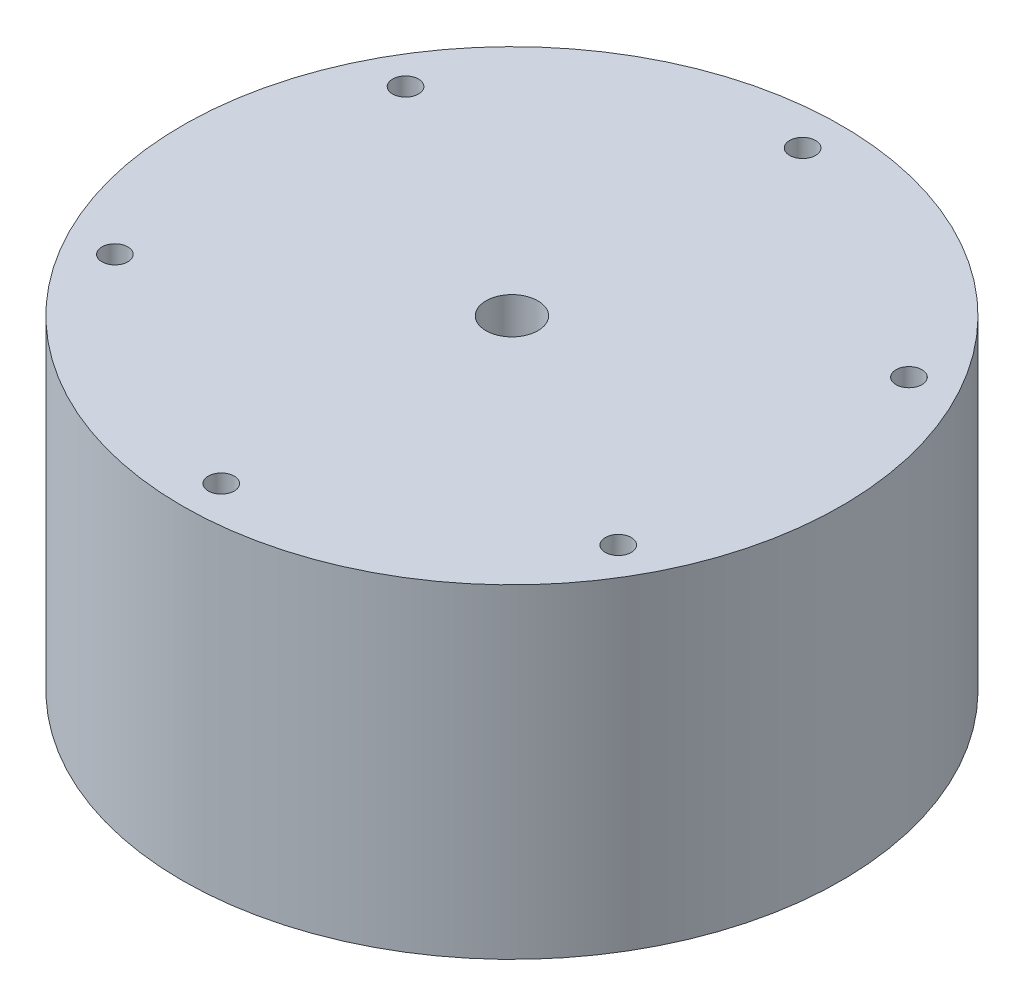
ISO-10303-21;
HEADER;
FILE_DESCRIPTION(('STEP AP214'),'2;1');
FILE_NAME('part.step','',(''),(''),'','','');
FILE_SCHEMA(('AUTOMOTIVE_DESIGN { 1 0 10303 214 1 1 1 1 }'));
ENDSEC;
DATA;
#1=APPLICATION_CONTEXT('core data for automotive mechanical design processes');
#2=APPLICATION_PROTOCOL_DEFINITION('international standard','automotive_design',2000,#1);
#3=PRODUCT_CONTEXT('',#1,'mechanical');
#4=PRODUCT('Part','Part','',(#3));
#5=PRODUCT_RELATED_PRODUCT_CATEGORY('part','',(#4));
#6=PRODUCT_DEFINITION_FORMATION('','',#4);
#7=PRODUCT_DEFINITION_CONTEXT('part definition',#1,'design');
#8=PRODUCT_DEFINITION('design','',#6,#7);
#9=PRODUCT_DEFINITION_SHAPE('','',#8);
#10=(LENGTH_UNIT() NAMED_UNIT(*) SI_UNIT(.MILLI.,.METRE.));
#11=(NAMED_UNIT(*) PLANE_ANGLE_UNIT() SI_UNIT($,.RADIAN.));
#12=(NAMED_UNIT(*) SI_UNIT($,.STERADIAN.) SOLID_ANGLE_UNIT());
#13=UNCERTAINTY_MEASURE_WITH_UNIT(LENGTH_MEASURE(1.E-05),#10,'distance_accuracy_value','');
#14=(GEOMETRIC_REPRESENTATION_CONTEXT(3) GLOBAL_UNCERTAINTY_ASSIGNED_CONTEXT((#13)) GLOBAL_UNIT_ASSIGNED_CONTEXT((#10,
#11,#12)) REPRESENTATION_CONTEXT('',''));
#15=CARTESIAN_POINT('',(0.,0.,0.));
#16=DIRECTION('',(0.,0.,1.));
#17=DIRECTION('',(1.,0.,0.));
#18=AXIS2_PLACEMENT_3D('',#15,#16,#17);
#19=CARTESIAN_POINT('',(0.,50.,0.));
#20=DIRECTION('',(0.,-1.,0.));
#21=DIRECTION('',(0.,0.,-1.));
#22=AXIS2_PLACEMENT_3D('',#19,#20,#21);
#23=CYLINDRICAL_SURFACE('',#22,50.8);
#24=CARTESIAN_POINT('',(0.,50.,0.));
#25=DIRECTION('',(0.,1.,0.));
#26=DIRECTION('',(0.,0.,1.));
#27=AXIS2_PLACEMENT_3D('',#24,#25,#26);
#28=CIRCLE('',#27,50.8);
#29=CARTESIAN_POINT('',(0.,50.,50.8));
#30=VERTEX_POINT('',#29);
#31=EDGE_CURVE('E10',#30,#30,#28,.T.);
#32=ORIENTED_EDGE('',*,*,#31,.F.);
#33=EDGE_LOOP('',(#32));
#34=FACE_BOUND('',#33,.T.);
#35=CARTESIAN_POINT('',(0.,0.,0.));
#36=DIRECTION('',(0.,1.,0.));
#37=DIRECTION('',(0.,0.,1.));
#38=AXIS2_PLACEMENT_3D('',#35,#36,#37);
#39=CIRCLE('',#38,50.8);
#40=CARTESIAN_POINT('',(0.,0.,50.8));
#41=VERTEX_POINT('',#40);
#42=EDGE_CURVE('E48',#41,#41,#39,.T.);
#43=ORIENTED_EDGE('',*,*,#42,.T.);
#44=EDGE_LOOP('',(#43));
#45=FACE_BOUND('',#44,.T.);
#46=ADVANCED_FACE('F41',(#34,#45),#23,.T.);
#47=CARTESIAN_POINT('',(0.,50.,0.));
#48=DIRECTION('',(0.,1.,0.));
#49=DIRECTION('',(0.,0.,1.));
#50=AXIS2_PLACEMENT_3D('',#47,#48,#49);
#51=PLANE('',#50);
#52=CARTESIAN_POINT('',(-38.7979380895426,50.,-22.4000000000004));
#53=DIRECTION('',(0.,1.,0.));
#54=DIRECTION('',(0.,0.,1.));
#55=AXIS2_PLACEMENT_3D('',#52,#53,#54);
#56=CIRCLE('',#55,2.);
#57=CARTESIAN_POINT('',(-38.7979380895426,50.,-20.4000000000004));
#58=VERTEX_POINT('',#57);
#59=EDGE_CURVE('E91',#58,#58,#56,.T.);
#60=ORIENTED_EDGE('',*,*,#59,.F.);
#61=EDGE_LOOP('',(#60));
#62=FACE_BOUND('',#61,.T.);
#63=CARTESIAN_POINT('',(-38.7979380895431,50.,22.3999999999996));
#64=DIRECTION('',(0.,1.,0.));
#65=DIRECTION('',(0.,0.,1.));
#66=AXIS2_PLACEMENT_3D('',#63,#64,#65);
#67=CIRCLE('',#66,2.);
#68=CARTESIAN_POINT('',(-38.7979380895431,50.,24.3999999999996));
#69=VERTEX_POINT('',#68);
#70=EDGE_CURVE('E94',#69,#69,#67,.T.);
#71=ORIENTED_EDGE('',*,*,#70,.F.);
#72=EDGE_LOOP('',(#71));
#73=FACE_BOUND('',#72,.T.);
#74=CARTESIAN_POINT('',(-3.12836727960345E-13,50.,44.8));
#75=DIRECTION('',(0.,1.,0.));
#76=DIRECTION('',(0.,0.,1.));
#77=AXIS2_PLACEMENT_3D('',#74,#75,#76);
#78=CIRCLE('',#77,2.);
#79=CARTESIAN_POINT('',(-3.12836727960345E-13,50.,46.8));
#80=VERTEX_POINT('',#79);
#81=EDGE_CURVE('E97',#80,#80,#78,.T.);
#82=ORIENTED_EDGE('',*,*,#81,.F.);
#83=EDGE_LOOP('',(#82));
#84=FACE_BOUND('',#83,.T.);
#85=CARTESIAN_POINT('',(38.7979380895428,50.,22.4000000000002));
#86=DIRECTION('',(0.,1.,0.));
#87=DIRECTION('',(0.,0.,1.));
#88=AXIS2_PLACEMENT_3D('',#85,#86,#87);
#89=CIRCLE('',#88,2.);
#90=CARTESIAN_POINT('',(38.7979380895428,50.,24.4000000000002));
#91=VERTEX_POINT('',#90);
#92=EDGE_CURVE('E100',#91,#91,#89,.T.);
#93=ORIENTED_EDGE('',*,*,#92,.F.);
#94=EDGE_LOOP('',(#93));
#95=FACE_BOUND('',#94,.T.);
#96=CARTESIAN_POINT('',(38.7979380895429,50.,-22.3999999999999));
#97=DIRECTION('',(0.,1.,0.));
#98=DIRECTION('',(0.,0.,1.));
#99=AXIS2_PLACEMENT_3D('',#96,#97,#98);
#100=CIRCLE('',#99,2.);
#101=CARTESIAN_POINT('',(38.7979380895429,50.,-20.3999999999999));
#102=VERTEX_POINT('',#101);
#103=EDGE_CURVE('E103',#102,#102,#100,.T.);
#104=ORIENTED_EDGE('',*,*,#103,.F.);
#105=EDGE_LOOP('',(#104));
#106=FACE_BOUND('',#105,.T.);
#107=CARTESIAN_POINT('',(0.,50.,-44.8));
#108=DIRECTION('',(0.,1.,0.));
#109=DIRECTION('',(0.,0.,1.));
#110=AXIS2_PLACEMENT_3D('',#107,#108,#109);
#111=CIRCLE('',#110,2.);
#112=CARTESIAN_POINT('',(0.,50.,-42.8));
#113=VERTEX_POINT('',#112);
#114=EDGE_CURVE('E90',#113,#113,#111,.T.);
#115=ORIENTED_EDGE('',*,*,#114,.F.);
#116=EDGE_LOOP('',(#115));
#117=FACE_BOUND('',#116,.T.);
#118=CARTESIAN_POINT('',(0.,50.,0.));
#119=DIRECTION('',(0.,1.,0.));
#120=DIRECTION('',(0.,0.,1.));
#121=AXIS2_PLACEMENT_3D('',#118,#119,#120);
#122=CIRCLE('',#121,4.);
#123=CARTESIAN_POINT('',(0.,50.,4.));
#124=VERTEX_POINT('',#123);
#125=EDGE_CURVE('E62',#124,#124,#122,.T.);
#126=ORIENTED_EDGE('',*,*,#125,.F.);
#127=EDGE_LOOP('',(#126));
#128=FACE_BOUND('',#127,.T.);
#129=ORIENTED_EDGE('',*,*,#31,.T.);
#130=EDGE_LOOP('',(#129));
#131=FACE_BOUND('',#130,.T.);
#132=ADVANCED_FACE('F112',(#62,#73,#84,#95,#106,#117,#128,#131),#51,.T.);
#133=CARTESIAN_POINT('',(0.,0.,0.));
#134=DIRECTION('',(0.,1.,0.));
#135=DIRECTION('',(0.,0.,1.));
#136=AXIS2_PLACEMENT_3D('',#133,#134,#135);
#137=PLANE('',#136);
#138=CARTESIAN_POINT('',(-38.7979380895426,0.,-22.4000000000004));
#139=DIRECTION('',(0.,1.,0.));
#140=DIRECTION('',(0.,0.,1.));
#141=AXIS2_PLACEMENT_3D('',#138,#139,#140);
#142=CIRCLE('',#141,2.);
#143=CARTESIAN_POINT('',(-38.7979380895426,0.,-20.4000000000004));
#144=VERTEX_POINT('',#143);
#145=EDGE_CURVE('E44',#144,#144,#142,.T.);
#146=ORIENTED_EDGE('',*,*,#145,.T.);
#147=EDGE_LOOP('',(#146));
#148=FACE_BOUND('',#147,.T.);
#149=CARTESIAN_POINT('',(-38.7979380895431,0.,22.3999999999996));
#150=DIRECTION('',(0.,1.,0.));
#151=DIRECTION('',(0.,0.,1.));
#152=AXIS2_PLACEMENT_3D('',#149,#150,#151);
#153=CIRCLE('',#152,2.);
#154=CARTESIAN_POINT('',(-38.7979380895431,0.,24.3999999999996));
#155=VERTEX_POINT('',#154);
#156=EDGE_CURVE('E73',#155,#155,#153,.T.);
#157=ORIENTED_EDGE('',*,*,#156,.T.);
#158=EDGE_LOOP('',(#157));
#159=FACE_BOUND('',#158,.T.);
#160=CARTESIAN_POINT('',(-3.12836727960345E-13,0.,44.8));
#161=DIRECTION('',(0.,1.,0.));
#162=DIRECTION('',(0.,0.,1.));
#163=AXIS2_PLACEMENT_3D('',#160,#161,#162);
#164=CIRCLE('',#163,2.);
#165=CARTESIAN_POINT('',(-3.12836727960345E-13,0.,46.8));
#166=VERTEX_POINT('',#165);
#167=EDGE_CURVE('E71',#166,#166,#164,.T.);
#168=ORIENTED_EDGE('',*,*,#167,.T.);
#169=EDGE_LOOP('',(#168));
#170=FACE_BOUND('',#169,.T.);
#171=CARTESIAN_POINT('',(38.7979380895428,0.,22.4000000000002));
#172=DIRECTION('',(0.,1.,0.));
#173=DIRECTION('',(0.,0.,1.));
#174=AXIS2_PLACEMENT_3D('',#171,#172,#173);
#175=CIRCLE('',#174,2.);
#176=CARTESIAN_POINT('',(38.7979380895428,0.,24.4000000000002));
#177=VERTEX_POINT('',#176);
#178=EDGE_CURVE('E68',#177,#177,#175,.T.);
#179=ORIENTED_EDGE('',*,*,#178,.T.);
#180=EDGE_LOOP('',(#179));
#181=FACE_BOUND('',#180,.T.);
#182=CARTESIAN_POINT('',(38.7979380895429,0.,-22.3999999999999));
#183=DIRECTION('',(0.,1.,0.));
#184=DIRECTION('',(0.,0.,1.));
#185=AXIS2_PLACEMENT_3D('',#182,#183,#184);
#186=CIRCLE('',#185,2.);
#187=CARTESIAN_POINT('',(38.7979380895429,0.,-20.3999999999999));
#188=VERTEX_POINT('',#187);
#189=EDGE_CURVE('E65',#188,#188,#186,.T.);
#190=ORIENTED_EDGE('',*,*,#189,.T.);
#191=EDGE_LOOP('',(#190));
#192=FACE_BOUND('',#191,.T.);
#193=CARTESIAN_POINT('',(0.,0.,-44.8));
#194=DIRECTION('',(0.,1.,0.));
#195=DIRECTION('',(0.,0.,1.));
#196=AXIS2_PLACEMENT_3D('',#193,#194,#195);
#197=CIRCLE('',#196,2.);
#198=CARTESIAN_POINT('',(0.,0.,-42.8));
#199=VERTEX_POINT('',#198);
#200=EDGE_CURVE('E61',#199,#199,#197,.T.);
#201=ORIENTED_EDGE('',*,*,#200,.T.);
#202=EDGE_LOOP('',(#201));
#203=FACE_BOUND('',#202,.T.);
#204=CARTESIAN_POINT('',(0.,0.,0.));
#205=DIRECTION('',(0.,1.,0.));
#206=DIRECTION('',(0.,0.,1.));
#207=AXIS2_PLACEMENT_3D('',#204,#205,#206);
#208=CIRCLE('',#207,38.1);
#209=CARTESIAN_POINT('',(0.,0.,38.1));
#210=VERTEX_POINT('',#209);
#211=EDGE_CURVE('E53',#210,#210,#208,.T.);
#212=ORIENTED_EDGE('',*,*,#211,.T.);
#213=EDGE_LOOP('',(#212));
#214=FACE_BOUND('',#213,.T.);
#215=ORIENTED_EDGE('',*,*,#42,.F.);
#216=EDGE_LOOP('',(#215));
#217=FACE_BOUND('',#216,.T.);
#218=ADVANCED_FACE('F115',(#148,#159,#170,#181,#192,#203,#214,#217),#137,.F.);
#219=CARTESIAN_POINT('',(0.,38.4999999999996,0.));
#220=DIRECTION('',(0.,1.,0.));
#221=DIRECTION('',(0.,0.,1.));
#222=AXIS2_PLACEMENT_3D('',#219,#220,#221);
#223=CYLINDRICAL_SURFACE('',#222,38.1);
#224=CARTESIAN_POINT('',(0.,2.,0.));
#225=DIRECTION('',(0.,1.,0.));
#226=DIRECTION('',(0.,0.,1.));
#227=AXIS2_PLACEMENT_3D('',#224,#225,#226);
#228=CIRCLE('',#227,38.1);
#229=CARTESIAN_POINT('',(0.,2.,38.1));
#230=VERTEX_POINT('',#229);
#231=EDGE_CURVE('E82',#230,#230,#228,.T.);
#232=ORIENTED_EDGE('',*,*,#231,.T.);
#233=EDGE_LOOP('',(#232));
#234=FACE_BOUND('',#233,.T.);
#235=ORIENTED_EDGE('',*,*,#211,.F.);
#236=EDGE_LOOP('',(#235));
#237=FACE_BOUND('',#236,.T.);
#238=ADVANCED_FACE('F144',(#234,#237),#223,.F.);
#239=CARTESIAN_POINT('',(38.1,2.,0.));
#240=DIRECTION('',(0.,-1.,0.));
#241=DIRECTION('',(0.,0.,-1.));
#242=AXIS2_PLACEMENT_3D('',#239,#240,#241);
#243=PLANE('',#242);
#244=CARTESIAN_POINT('',(0.,2.,0.));
#245=DIRECTION('',(0.,1.,0.));
#246=DIRECTION('',(0.,0.,1.));
#247=AXIS2_PLACEMENT_3D('',#244,#245,#246);
#248=CIRCLE('',#247,36.5);
#249=CARTESIAN_POINT('',(0.,2.,36.5));
#250=VERTEX_POINT('',#249);
#251=EDGE_CURVE('E78',#250,#250,#248,.T.);
#252=ORIENTED_EDGE('',*,*,#251,.T.);
#253=EDGE_LOOP('',(#252));
#254=FACE_BOUND('',#253,.T.);
#255=ORIENTED_EDGE('',*,*,#231,.F.);
#256=EDGE_LOOP('',(#255));
#257=FACE_BOUND('',#256,.T.);
#258=ADVANCED_FACE('F131',(#254,#257),#243,.T.);
#259=CARTESIAN_POINT('',(0.,2.,0.));
#260=DIRECTION('',(0.,-1.,0.));
#261=DIRECTION('',(0.,0.,-1.));
#262=AXIS2_PLACEMENT_3D('',#259,#260,#261);
#263=CONICAL_SURFACE('',#262,36.5,0.785398163397453);
#264=CARTESIAN_POINT('',(0.,34.4999999999997,0.));
#265=DIRECTION('',(0.,-1.,0.));
#266=DIRECTION('',(0.,0.,-1.));
#267=AXIS2_PLACEMENT_3D('',#264,#265,#266);
#268=CIRCLE('',#267,4.);
#269=CARTESIAN_POINT('',(0.,34.4999999999997,-4.));
#270=VERTEX_POINT('',#269);
#271=EDGE_CURVE('E58',#270,#270,#268,.T.);
#272=ORIENTED_EDGE('',*,*,#271,.F.);
#273=EDGE_LOOP('',(#272));
#274=FACE_BOUND('',#273,.T.);
#275=ORIENTED_EDGE('',*,*,#251,.F.);
#276=EDGE_LOOP('',(#275));
#277=FACE_BOUND('',#276,.T.);
#278=ADVANCED_FACE('F122',(#274,#277),#263,.F.);
#279=CARTESIAN_POINT('',(0.,-21.,0.));
#280=DIRECTION('',(0.,1.,0.));
#281=DIRECTION('',(0.,0.,1.));
#282=AXIS2_PLACEMENT_3D('',#279,#280,#281);
#283=CYLINDRICAL_SURFACE('',#282,4.);
#284=ORIENTED_EDGE('',*,*,#271,.T.);
#285=EDGE_LOOP('',(#284));
#286=FACE_BOUND('',#285,.T.);
#287=ORIENTED_EDGE('',*,*,#125,.T.);
#288=EDGE_LOOP('',(#287));
#289=FACE_BOUND('',#288,.T.);
#290=ADVANCED_FACE('F120',(#286,#289),#283,.F.);
#291=CARTESIAN_POINT('',(0.,-21.,-44.8));
#292=DIRECTION('',(0.,1.,0.));
#293=DIRECTION('',(0.,0.,1.));
#294=AXIS2_PLACEMENT_3D('',#291,#292,#293);
#295=CYLINDRICAL_SURFACE('',#294,2.);
#296=ORIENTED_EDGE('',*,*,#114,.T.);
#297=EDGE_LOOP('',(#296));
#298=FACE_BOUND('',#297,.T.);
#299=ORIENTED_EDGE('',*,*,#200,.F.);
#300=EDGE_LOOP('',(#299));
#301=FACE_BOUND('',#300,.T.);
#302=ADVANCED_FACE('F109',(#298,#301),#295,.F.);
#303=CARTESIAN_POINT('',(38.7979380895429,-21.,-22.3999999999999));
#304=DIRECTION('',(0.,1.,0.));
#305=DIRECTION('',(0.,0.,1.));
#306=AXIS2_PLACEMENT_3D('',#303,#304,#305);
#307=CYLINDRICAL_SURFACE('',#306,2.);
#308=ORIENTED_EDGE('',*,*,#103,.T.);
#309=EDGE_LOOP('',(#308));
#310=FACE_BOUND('',#309,.T.);
#311=ORIENTED_EDGE('',*,*,#189,.F.);
#312=EDGE_LOOP('',(#311));
#313=FACE_BOUND('',#312,.T.);
#314=ADVANCED_FACE('F129',(#310,#313),#307,.F.);
#315=CARTESIAN_POINT('',(38.7979380895428,-21.,22.4000000000002));
#316=DIRECTION('',(0.,1.,0.));
#317=DIRECTION('',(0.,0.,1.));
#318=AXIS2_PLACEMENT_3D('',#315,#316,#317);
#319=CYLINDRICAL_SURFACE('',#318,2.);
#320=ORIENTED_EDGE('',*,*,#92,.T.);
#321=EDGE_LOOP('',(#320));
#322=FACE_BOUND('',#321,.T.);
#323=ORIENTED_EDGE('',*,*,#178,.F.);
#324=EDGE_LOOP('',(#323));
#325=FACE_BOUND('',#324,.T.);
#326=ADVANCED_FACE('F201',(#322,#325),#319,.F.);
#327=CARTESIAN_POINT('',(-3.12836727960345E-13,-21.,44.8));
#328=DIRECTION('',(0.,1.,0.));
#329=DIRECTION('',(0.,0.,1.));
#330=AXIS2_PLACEMENT_3D('',#327,#328,#329);
#331=CYLINDRICAL_SURFACE('',#330,2.);
#332=ORIENTED_EDGE('',*,*,#81,.T.);
#333=EDGE_LOOP('',(#332));
#334=FACE_BOUND('',#333,.T.);
#335=ORIENTED_EDGE('',*,*,#167,.F.);
#336=EDGE_LOOP('',(#335));
#337=FACE_BOUND('',#336,.T.);
#338=ADVANCED_FACE('F210',(#334,#337),#331,.F.);
#339=CARTESIAN_POINT('',(-38.7979380895431,-21.,22.3999999999996));
#340=DIRECTION('',(0.,1.,0.));
#341=DIRECTION('',(0.,0.,1.));
#342=AXIS2_PLACEMENT_3D('',#339,#340,#341);
#343=CYLINDRICAL_SURFACE('',#342,2.);
#344=ORIENTED_EDGE('',*,*,#70,.T.);
#345=EDGE_LOOP('',(#344));
#346=FACE_BOUND('',#345,.T.);
#347=ORIENTED_EDGE('',*,*,#156,.F.);
#348=EDGE_LOOP('',(#347));
#349=FACE_BOUND('',#348,.T.);
#350=ADVANCED_FACE('F219',(#346,#349),#343,.F.);
#351=CARTESIAN_POINT('',(-38.7979380895426,-21.,-22.4000000000004));
#352=DIRECTION('',(0.,1.,0.));
#353=DIRECTION('',(0.,0.,1.));
#354=AXIS2_PLACEMENT_3D('',#351,#352,#353);
#355=CYLINDRICAL_SURFACE('',#354,2.);
#356=ORIENTED_EDGE('',*,*,#59,.T.);
#357=EDGE_LOOP('',(#356));
#358=FACE_BOUND('',#357,.T.);
#359=ORIENTED_EDGE('',*,*,#145,.F.);
#360=EDGE_LOOP('',(#359));
#361=FACE_BOUND('',#360,.T.);
#362=ADVANCED_FACE('F228',(#358,#361),#355,.F.);
#363=CLOSED_SHELL('',(#46,#132,#218,#238,#258,#278,#290,#302,#314,#326,#338,#350,#362));
#364=MANIFOLD_SOLID_BREP('B2',#363);
#365=ADVANCED_BREP_SHAPE_REPRESENTATION('',(#18,#364),#14);
#366=SHAPE_DEFINITION_REPRESENTATION(#9,#365);
ENDSEC;
END-ISO-10303-21;
